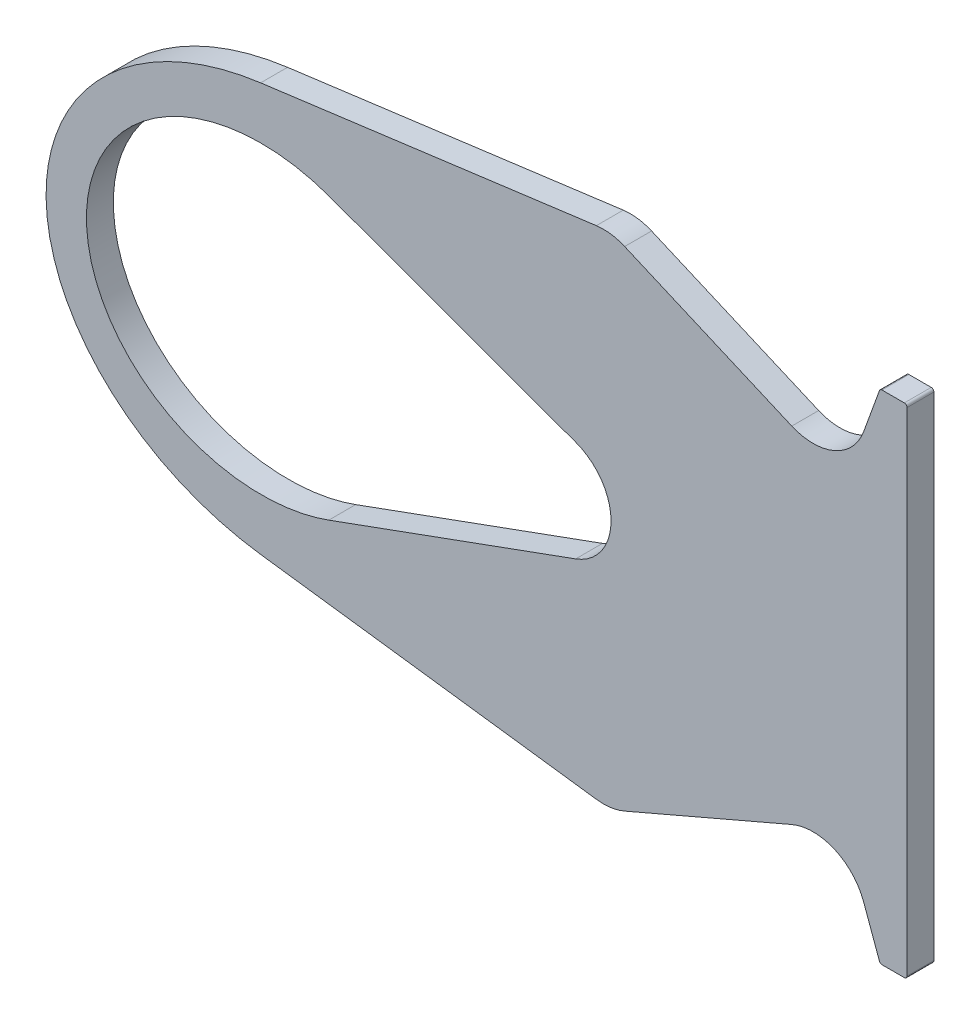
ISO-10303-21;
HEADER;
FILE_DESCRIPTION(('STEP AP214'),'2;1');
FILE_NAME('part.step','',(''),(''),'','','');
FILE_SCHEMA(('AUTOMOTIVE_DESIGN { 1 0 10303 214 1 1 1 1 }'));
ENDSEC;
DATA;
#1=APPLICATION_CONTEXT('core data for automotive mechanical design processes');
#2=APPLICATION_PROTOCOL_DEFINITION('international standard','automotive_design',2000,#1);
#3=PRODUCT_CONTEXT('',#1,'mechanical');
#4=PRODUCT('Part','Part','',(#3));
#5=PRODUCT_RELATED_PRODUCT_CATEGORY('part','',(#4));
#6=PRODUCT_DEFINITION_FORMATION('','',#4);
#7=PRODUCT_DEFINITION_CONTEXT('part definition',#1,'design');
#8=PRODUCT_DEFINITION('design','',#6,#7);
#9=PRODUCT_DEFINITION_SHAPE('','',#8);
#10=(LENGTH_UNIT() NAMED_UNIT(*) SI_UNIT(.MILLI.,.METRE.));
#11=(NAMED_UNIT(*) PLANE_ANGLE_UNIT() SI_UNIT($,.RADIAN.));
#12=(NAMED_UNIT(*) SI_UNIT($,.STERADIAN.) SOLID_ANGLE_UNIT());
#13=UNCERTAINTY_MEASURE_WITH_UNIT(LENGTH_MEASURE(1.E-05),#10,'distance_accuracy_value','');
#14=(GEOMETRIC_REPRESENTATION_CONTEXT(3) GLOBAL_UNCERTAINTY_ASSIGNED_CONTEXT((#13)) GLOBAL_UNIT_ASSIGNED_CONTEXT((#10,
#11,#12)) REPRESENTATION_CONTEXT('',''));
#15=CARTESIAN_POINT('',(0.,0.,0.));
#16=DIRECTION('',(0.,0.,1.));
#17=DIRECTION('',(1.,0.,0.));
#18=AXIS2_PLACEMENT_3D('',#15,#16,#17);
#19=CARTESIAN_POINT('',(-225.,0.,10.));
#20=DIRECTION('',(0.,0.,1.));
#21=DIRECTION('',(1.,0.,0.));
#22=AXIS2_PLACEMENT_3D('',#19,#20,#21);
#23=PLANE('',#22);
#24=CARTESIAN_POINT('',(-112.849996932684,72.5,10.));
#25=DIRECTION('',(0.,0.,1.));
#26=DIRECTION('',(-1.,0.,0.));
#27=AXIS2_PLACEMENT_3D('',#24,#25,#26);
#28=CIRCLE('',#27,19.9999999999999);
#29=CARTESIAN_POINT('',(-104.941269692229,90.8698675399713,10.));
#30=VERTEX_POINT('',#29);
#31=CARTESIAN_POINT('',(-115.460520777085,92.3288972274762,10.));
#32=VERTEX_POINT('',#31);
#33=EDGE_CURVE('E432',#30,#32,#28,.T.);
#34=ORIENTED_EDGE('',*,*,#33,.T.);
#35=DIRECTION('',(-0.99144486137381,-0.130526192220055,0.));
#36=VECTOR('',#35,1.);
#37=CARTESIAN_POINT('',(-115.460520777085,92.3288972274762,10.));
#38=LINE('',#37,#36);
#39=CARTESIAN_POINT('',(-240.250906005808,75.8999313372211,10.));
#40=VERTEX_POINT('',#39);
#41=EDGE_CURVE('E310',#32,#40,#38,.T.);
#42=ORIENTED_EDGE('',*,*,#41,.T.);
#43=CARTESIAN_POINT('',(-225.,0.,10.));
#44=DIRECTION('',(0.,0.,1.));
#45=DIRECTION('',(1.,0.,0.));
#46=AXIS2_PLACEMENT_3D('',#43,#44,#45);
#47=ELLIPSE('',#46,95.,76.8972884240534);
#48=CARTESIAN_POINT('',(-240.250906005808,-75.8999313372211,10.));
#49=VERTEX_POINT('',#48);
#50=EDGE_CURVE('E305',#40,#49,#47,.T.);
#51=ORIENTED_EDGE('',*,*,#50,.T.);
#52=DIRECTION('',(0.99144486137381,-0.130526192220055,0.));
#53=VECTOR('',#52,1.);
#54=CARTESIAN_POINT('',(-115.460520777085,-92.3288972274762,10.));
#55=LINE('',#54,#53);
#56=CARTESIAN_POINT('',(-115.460520777085,-92.3288972274762,10.));
#57=VERTEX_POINT('',#56);
#58=EDGE_CURVE('E309',#49,#57,#55,.T.);
#59=ORIENTED_EDGE('',*,*,#58,.T.);
#60=CARTESIAN_POINT('',(-112.849996932684,-72.5,10.));
#61=DIRECTION('',(0.,0.,1.));
#62=DIRECTION('',(1.,0.,0.));
#63=AXIS2_PLACEMENT_3D('',#60,#61,#62);
#64=CIRCLE('',#63,20.);
#65=CARTESIAN_POINT('',(-104.941269692229,-90.8698675399714,10.));
#66=VERTEX_POINT('',#65);
#67=EDGE_CURVE('E313',#57,#66,#64,.T.);
#68=ORIENTED_EDGE('',*,*,#67,.T.);
#69=DIRECTION('',(0.918493376998569,0.395436362022721,0.));
#70=VECTOR('',#69,1.);
#71=CARTESIAN_POINT('',(-42.8319850326347,-64.1301324600287,10.));
#72=LINE('',#71,#70);
#73=CARTESIAN_POINT('',(-42.8319850326347,-64.1301324600287,10.));
#74=VERTEX_POINT('',#73);
#75=EDGE_CURVE('E315',#66,#74,#72,.T.);
#76=ORIENTED_EDGE('',*,*,#75,.T.);
#77=CARTESIAN_POINT('',(-34.9232577921802,-82.5,10.));
#78=DIRECTION('',(0.,0.,-1.));
#79=DIRECTION('',(1.,0.,0.));
#80=AXIS2_PLACEMENT_3D('',#77,#78,#79);
#81=CIRCLE('',#80,20.);
#82=CARTESIAN_POINT('',(-16.1294053764621,-75.6595971334867,10.));
#83=VERTEX_POINT('',#82);
#84=EDGE_CURVE('E317',#74,#83,#81,.T.);
#85=ORIENTED_EDGE('',*,*,#84,.T.);
#86=DIRECTION('',(0.342020143325667,-0.939692620785909,0.));
#87=VECTOR('',#86,1.);
#88=CARTESIAN_POINT('',(-10.2394850825762,-91.8420201433257,10.));
#89=LINE('',#88,#87);
#90=CARTESIAN_POINT('',(-10.2394850825762,-91.8420201433257,10.));
#91=VERTEX_POINT('',#90);
#92=EDGE_CURVE('E319',#83,#91,#89,.T.);
#93=ORIENTED_EDGE('',*,*,#92,.T.);
#94=CARTESIAN_POINT('',(-9.29979246179027,-91.5,10.));
#95=DIRECTION('',(0.,0.,1.));
#96=DIRECTION('',(-1.,0.,0.));
#97=AXIS2_PLACEMENT_3D('',#94,#95,#96);
#98=CIRCLE('',#97,1.);
#99=CARTESIAN_POINT('',(-9.29979246179027,-92.5,10.));
#100=VERTEX_POINT('',#99);
#101=EDGE_CURVE('E321',#91,#100,#98,.T.);
#102=ORIENTED_EDGE('',*,*,#101,.T.);
#103=DIRECTION('',(1.,0.,0.));
#104=VECTOR('',#103,1.);
#105=CARTESIAN_POINT('',(-1.,-92.5,10.));
#106=LINE('',#105,#104);
#107=CARTESIAN_POINT('',(-1.,-92.5,10.));
#108=VERTEX_POINT('',#107);
#109=EDGE_CURVE('E323',#100,#108,#106,.T.);
#110=ORIENTED_EDGE('',*,*,#109,.T.);
#111=CARTESIAN_POINT('',(-1.,-91.5,10.));
#112=DIRECTION('',(0.,0.,1.));
#113=DIRECTION('',(1.,0.,0.));
#114=AXIS2_PLACEMENT_3D('',#111,#112,#113);
#115=CIRCLE('',#114,1.);
#116=CARTESIAN_POINT('',(0.,-91.5,10.));
#117=VERTEX_POINT('',#116);
#118=EDGE_CURVE('E325',#108,#117,#115,.T.);
#119=ORIENTED_EDGE('',*,*,#118,.T.);
#120=DIRECTION('',(0.,1.,0.));
#121=VECTOR('',#120,1.);
#122=CARTESIAN_POINT('',(0.,-91.5,10.));
#123=LINE('',#122,#121);
#124=CARTESIAN_POINT('',(0.,91.5,10.));
#125=VERTEX_POINT('',#124);
#126=EDGE_CURVE('E327',#117,#125,#123,.T.);
#127=ORIENTED_EDGE('',*,*,#126,.T.);
#128=CARTESIAN_POINT('',(-1.00000000000002,91.5,10.));
#129=DIRECTION('',(0.,0.,1.));
#130=DIRECTION('',(-1.,0.,0.));
#131=AXIS2_PLACEMENT_3D('',#128,#129,#130);
#132=CIRCLE('',#131,1.);
#133=CARTESIAN_POINT('',(-1.00000000000002,92.5,10.));
#134=VERTEX_POINT('',#133);
#135=EDGE_CURVE('E329',#125,#134,#132,.T.);
#136=ORIENTED_EDGE('',*,*,#135,.T.);
#137=DIRECTION('',(-1.,0.,0.));
#138=VECTOR('',#137,1.);
#139=CARTESIAN_POINT('',(-1.00000000000002,92.5,10.));
#140=LINE('',#139,#138);
#141=CARTESIAN_POINT('',(-9.29979246179029,92.5,10.));
#142=VERTEX_POINT('',#141);
#143=EDGE_CURVE('E331',#134,#142,#140,.T.);
#144=ORIENTED_EDGE('',*,*,#143,.T.);
#145=CARTESIAN_POINT('',(-9.29979246179029,91.5,10.));
#146=DIRECTION('',(0.,0.,1.));
#147=DIRECTION('',(-1.,0.,0.));
#148=AXIS2_PLACEMENT_3D('',#145,#146,#147);
#149=CIRCLE('',#148,1.);
#150=CARTESIAN_POINT('',(-10.2394850825762,91.8420201433257,10.));
#151=VERTEX_POINT('',#150);
#152=EDGE_CURVE('E333',#142,#151,#149,.T.);
#153=ORIENTED_EDGE('',*,*,#152,.T.);
#154=DIRECTION('',(-0.342020143325668,-0.939692620785909,0.));
#155=VECTOR('',#154,1.);
#156=CARTESIAN_POINT('',(-10.2394850825762,91.8420201433257,10.));
#157=LINE('',#156,#155);
#158=CARTESIAN_POINT('',(-16.1294053764621,75.6595971334866,10.));
#159=VERTEX_POINT('',#158);
#160=EDGE_CURVE('E335',#151,#159,#157,.T.);
#161=ORIENTED_EDGE('',*,*,#160,.T.);
#162=CARTESIAN_POINT('',(-34.9232577921802,82.5,10.));
#163=DIRECTION('',(0.,0.,-1.));
#164=DIRECTION('',(-1.,0.,0.));
#165=AXIS2_PLACEMENT_3D('',#162,#163,#164);
#166=CIRCLE('',#165,20.);
#167=CARTESIAN_POINT('',(-42.8319850326347,64.1301324600286,10.));
#168=VERTEX_POINT('',#167);
#169=EDGE_CURVE('E337',#159,#168,#166,.T.);
#170=ORIENTED_EDGE('',*,*,#169,.T.);
#171=DIRECTION('',(-0.918493376998569,0.395436362022721,0.));
#172=VECTOR('',#171,1.);
#173=CARTESIAN_POINT('',(-42.8319850326347,64.1301324600287,10.));
#174=LINE('',#173,#172);
#175=EDGE_CURVE('E339',#168,#30,#174,.T.);
#176=ORIENTED_EDGE('',*,*,#175,.T.);
#177=EDGE_LOOP('',(#34,#42,#51,#59,#68,#76,#85,#93,#102,#110,#119,#127,#136,#144,#153,#161,#170,#176));
#178=FACE_BOUND('',#177,.T.);
#179=DIRECTION('',(-0.939692620785908,0.34202014332567,0.));
#180=VECTOR('',#179,1.);
#181=CARTESIAN_POINT('',(-214.922257217189,52.1927293032733,10.));
#182=LINE('',#181,#180);
#183=CARTESIAN_POINT('',(-123.159597133487,18.7938524157181,10.));
#184=VERTEX_POINT('',#183);
#185=CARTESIAN_POINT('',(-214.922257217189,52.1927293032733,10.));
#186=VERTEX_POINT('',#185);
#187=EDGE_CURVE('E216',#184,#186,#182,.T.);
#188=ORIENTED_EDGE('',*,*,#187,.F.);
#189=CARTESIAN_POINT('',(-130.,0.,10.));
#190=DIRECTION('',(0.,0.,1.));
#191=DIRECTION('',(1.,0.,0.));
#192=AXIS2_PLACEMENT_3D('',#189,#190,#191);
#193=CIRCLE('',#192,20.);
#194=CARTESIAN_POINT('',(-123.159597133487,-18.7938524157182,10.));
#195=VERTEX_POINT('',#194);
#196=EDGE_CURVE('E205',#195,#184,#193,.T.);
#197=ORIENTED_EDGE('',*,*,#196,.F.);
#198=DIRECTION('',(0.939692620785908,0.34202014332567,0.));
#199=VECTOR('',#198,1.);
#200=CARTESIAN_POINT('',(-214.922257217189,-52.1927293032734,10.));
#201=LINE('',#200,#199);
#202=CARTESIAN_POINT('',(-214.922257217189,-52.1927293032734,10.));
#203=VERTEX_POINT('',#202);
#204=EDGE_CURVE('E221',#203,#195,#201,.T.);
#205=ORIENTED_EDGE('',*,*,#204,.F.);
#206=CARTESIAN_POINT('',(-240.,0.,10.));
#207=DIRECTION('',(0.,0.,1.));
#208=DIRECTION('',(1.,0.,0.));
#209=AXIS2_PLACEMENT_3D('',#206,#207,#208);
#210=ELLIPSE('',#209,65.,56.5727216815088);
#211=EDGE_CURVE('E218',#186,#203,#210,.T.);
#212=ORIENTED_EDGE('',*,*,#211,.F.);
#213=EDGE_LOOP('',(#188,#197,#205,#212));
#214=FACE_BOUND('',#213,.T.);
#215=ADVANCED_FACE('F41',(#178,#214),#23,.T.);
#216=CARTESIAN_POINT('',(-225.,0.,0.));
#217=DIRECTION('',(0.,0.,1.));
#218=DIRECTION('',(1.,0.,0.));
#219=AXIS2_PLACEMENT_3D('',#216,#217,#218);
#220=PLANE('',#219);
#221=CARTESIAN_POINT('',(-112.849996932684,72.5,0.));
#222=DIRECTION('',(0.,0.,1.));
#223=DIRECTION('',(-1.,0.,0.));
#224=AXIS2_PLACEMENT_3D('',#221,#222,#223);
#225=CIRCLE('',#224,19.9999999999999);
#226=CARTESIAN_POINT('',(-104.941269692229,90.8698675399713,0.));
#227=VERTEX_POINT('',#226);
#228=CARTESIAN_POINT('',(-115.460520777085,92.3288972274762,0.));
#229=VERTEX_POINT('',#228);
#230=EDGE_CURVE('E206',#227,#229,#225,.T.);
#231=ORIENTED_EDGE('',*,*,#230,.F.);
#232=DIRECTION('',(-0.918493376998569,0.395436362022721,0.));
#233=VECTOR('',#232,1.);
#234=CARTESIAN_POINT('',(-42.8319850326347,64.1301324600287,0.));
#235=LINE('',#234,#233);
#236=CARTESIAN_POINT('',(-42.8319850326347,64.1301324600286,0.));
#237=VERTEX_POINT('',#236);
#238=EDGE_CURVE('E431',#237,#227,#235,.T.);
#239=ORIENTED_EDGE('',*,*,#238,.F.);
#240=CARTESIAN_POINT('',(-34.9232577921802,82.5,0.));
#241=DIRECTION('',(0.,0.,-1.));
#242=DIRECTION('',(-1.,0.,0.));
#243=AXIS2_PLACEMENT_3D('',#240,#241,#242);
#244=CIRCLE('',#243,20.);
#245=CARTESIAN_POINT('',(-16.1294053764621,75.6595971334866,0.));
#246=VERTEX_POINT('',#245);
#247=EDGE_CURVE('E429',#246,#237,#244,.T.);
#248=ORIENTED_EDGE('',*,*,#247,.F.);
#249=DIRECTION('',(-0.342020143325668,-0.939692620785909,0.));
#250=VECTOR('',#249,1.);
#251=CARTESIAN_POINT('',(-10.2394850825762,91.8420201433257,0.));
#252=LINE('',#251,#250);
#253=CARTESIAN_POINT('',(-10.2394850825762,91.8420201433257,0.));
#254=VERTEX_POINT('',#253);
#255=EDGE_CURVE('E427',#254,#246,#252,.T.);
#256=ORIENTED_EDGE('',*,*,#255,.F.);
#257=CARTESIAN_POINT('',(-9.29979246179029,91.5,0.));
#258=DIRECTION('',(0.,0.,1.));
#259=DIRECTION('',(-1.,0.,0.));
#260=AXIS2_PLACEMENT_3D('',#257,#258,#259);
#261=CIRCLE('',#260,1.);
#262=CARTESIAN_POINT('',(-9.29979246179029,92.5,0.));
#263=VERTEX_POINT('',#262);
#264=EDGE_CURVE('E425',#263,#254,#261,.T.);
#265=ORIENTED_EDGE('',*,*,#264,.F.);
#266=DIRECTION('',(-1.,0.,0.));
#267=VECTOR('',#266,1.);
#268=CARTESIAN_POINT('',(-1.00000000000002,92.5,0.));
#269=LINE('',#268,#267);
#270=CARTESIAN_POINT('',(-1.00000000000002,92.5,0.));
#271=VERTEX_POINT('',#270);
#272=EDGE_CURVE('E423',#271,#263,#269,.T.);
#273=ORIENTED_EDGE('',*,*,#272,.F.);
#274=CARTESIAN_POINT('',(-1.00000000000002,91.5,0.));
#275=DIRECTION('',(0.,0.,1.));
#276=DIRECTION('',(-1.,0.,0.));
#277=AXIS2_PLACEMENT_3D('',#274,#275,#276);
#278=CIRCLE('',#277,1.);
#279=CARTESIAN_POINT('',(0.,91.5,0.));
#280=VERTEX_POINT('',#279);
#281=EDGE_CURVE('E421',#280,#271,#278,.T.);
#282=ORIENTED_EDGE('',*,*,#281,.F.);
#283=DIRECTION('',(0.,1.,0.));
#284=VECTOR('',#283,1.);
#285=CARTESIAN_POINT('',(0.,-91.5,0.));
#286=LINE('',#285,#284);
#287=CARTESIAN_POINT('',(0.,-91.5,0.));
#288=VERTEX_POINT('',#287);
#289=EDGE_CURVE('E419',#288,#280,#286,.T.);
#290=ORIENTED_EDGE('',*,*,#289,.F.);
#291=CARTESIAN_POINT('',(-1.,-91.5,0.));
#292=DIRECTION('',(0.,0.,1.));
#293=DIRECTION('',(1.,0.,0.));
#294=AXIS2_PLACEMENT_3D('',#291,#292,#293);
#295=CIRCLE('',#294,1.);
#296=CARTESIAN_POINT('',(-1.,-92.5,0.));
#297=VERTEX_POINT('',#296);
#298=EDGE_CURVE('E417',#297,#288,#295,.T.);
#299=ORIENTED_EDGE('',*,*,#298,.F.);
#300=DIRECTION('',(1.,0.,0.));
#301=VECTOR('',#300,1.);
#302=CARTESIAN_POINT('',(-1.,-92.5,0.));
#303=LINE('',#302,#301);
#304=CARTESIAN_POINT('',(-9.29979246179027,-92.5,0.));
#305=VERTEX_POINT('',#304);
#306=EDGE_CURVE('E415',#305,#297,#303,.T.);
#307=ORIENTED_EDGE('',*,*,#306,.F.);
#308=CARTESIAN_POINT('',(-9.29979246179027,-91.5,0.));
#309=DIRECTION('',(0.,0.,1.));
#310=DIRECTION('',(-1.,0.,0.));
#311=AXIS2_PLACEMENT_3D('',#308,#309,#310);
#312=CIRCLE('',#311,1.);
#313=CARTESIAN_POINT('',(-10.2394850825762,-91.8420201433257,0.));
#314=VERTEX_POINT('',#313);
#315=EDGE_CURVE('E413',#314,#305,#312,.T.);
#316=ORIENTED_EDGE('',*,*,#315,.F.);
#317=DIRECTION('',(0.342020143325667,-0.939692620785909,0.));
#318=VECTOR('',#317,1.);
#319=CARTESIAN_POINT('',(-10.2394850825762,-91.8420201433257,0.));
#320=LINE('',#319,#318);
#321=CARTESIAN_POINT('',(-16.1294053764621,-75.6595971334867,0.));
#322=VERTEX_POINT('',#321);
#323=EDGE_CURVE('E411',#322,#314,#320,.T.);
#324=ORIENTED_EDGE('',*,*,#323,.F.);
#325=CARTESIAN_POINT('',(-34.9232577921802,-82.5,0.));
#326=DIRECTION('',(0.,0.,-1.));
#327=DIRECTION('',(1.,0.,0.));
#328=AXIS2_PLACEMENT_3D('',#325,#326,#327);
#329=CIRCLE('',#328,20.);
#330=CARTESIAN_POINT('',(-42.8319850326347,-64.1301324600287,0.));
#331=VERTEX_POINT('',#330);
#332=EDGE_CURVE('E409',#331,#322,#329,.T.);
#333=ORIENTED_EDGE('',*,*,#332,.F.);
#334=DIRECTION('',(0.918493376998569,0.395436362022721,0.));
#335=VECTOR('',#334,1.);
#336=CARTESIAN_POINT('',(-42.8319850326347,-64.1301324600287,0.));
#337=LINE('',#336,#335);
#338=CARTESIAN_POINT('',(-104.941269692229,-90.8698675399714,0.));
#339=VERTEX_POINT('',#338);
#340=EDGE_CURVE('E407',#339,#331,#337,.T.);
#341=ORIENTED_EDGE('',*,*,#340,.F.);
#342=CARTESIAN_POINT('',(-112.849996932684,-72.5,0.));
#343=DIRECTION('',(0.,0.,1.));
#344=DIRECTION('',(1.,0.,0.));
#345=AXIS2_PLACEMENT_3D('',#342,#343,#344);
#346=CIRCLE('',#345,20.);
#347=CARTESIAN_POINT('',(-115.460520777085,-92.3288972274762,0.));
#348=VERTEX_POINT('',#347);
#349=EDGE_CURVE('E401',#348,#339,#346,.T.);
#350=ORIENTED_EDGE('',*,*,#349,.F.);
#351=DIRECTION('',(0.99144486137381,-0.130526192220055,0.));
#352=VECTOR('',#351,1.);
#353=CARTESIAN_POINT('',(-115.460520777085,-92.3288972274762,0.));
#354=LINE('',#353,#352);
#355=CARTESIAN_POINT('',(-240.250906005808,-75.8999313372211,0.));
#356=VERTEX_POINT('',#355);
#357=EDGE_CURVE('E399',#356,#348,#354,.T.);
#358=ORIENTED_EDGE('',*,*,#357,.F.);
#359=CARTESIAN_POINT('',(-225.,0.,0.));
#360=DIRECTION('',(0.,0.,1.));
#361=DIRECTION('',(1.,0.,0.));
#362=AXIS2_PLACEMENT_3D('',#359,#360,#361);
#363=ELLIPSE('',#362,95.,76.8972884240534);
#364=CARTESIAN_POINT('',(-240.250906005808,75.8999313372211,0.));
#365=VERTEX_POINT('',#364);
#366=EDGE_CURVE('E393',#365,#356,#363,.T.);
#367=ORIENTED_EDGE('',*,*,#366,.F.);
#368=DIRECTION('',(-0.99144486137381,-0.130526192220055,0.));
#369=VECTOR('',#368,1.);
#370=CARTESIAN_POINT('',(-115.460520777085,92.3288972274762,0.));
#371=LINE('',#370,#369);
#372=EDGE_CURVE('E397',#229,#365,#371,.T.);
#373=ORIENTED_EDGE('',*,*,#372,.F.);
#374=EDGE_LOOP('',(#231,#239,#248,#256,#265,#273,#282,#290,#299,#307,#316,#324,#333,#341,#350,
#358,#367,#373));
#375=FACE_BOUND('',#374,.T.);
#376=CARTESIAN_POINT('',(-130.,0.,0.));
#377=DIRECTION('',(0.,0.,1.));
#378=DIRECTION('',(1.,0.,0.));
#379=AXIS2_PLACEMENT_3D('',#376,#377,#378);
#380=CIRCLE('',#379,20.);
#381=CARTESIAN_POINT('',(-123.159597133487,-18.7938524157182,0.));
#382=VERTEX_POINT('',#381);
#383=CARTESIAN_POINT('',(-123.159597133487,18.7938524157181,0.));
#384=VERTEX_POINT('',#383);
#385=EDGE_CURVE('E64',#382,#384,#380,.T.);
#386=ORIENTED_EDGE('',*,*,#385,.T.);
#387=DIRECTION('',(-0.939692620785908,0.34202014332567,0.));
#388=VECTOR('',#387,1.);
#389=CARTESIAN_POINT('',(-214.922257217189,52.1927293032733,0.));
#390=LINE('',#389,#388);
#391=CARTESIAN_POINT('',(-214.922257217189,52.1927293032733,0.));
#392=VERTEX_POINT('',#391);
#393=EDGE_CURVE('E192',#384,#392,#390,.T.);
#394=ORIENTED_EDGE('',*,*,#393,.T.);
#395=CARTESIAN_POINT('',(-240.,0.,0.));
#396=DIRECTION('',(0.,0.,1.));
#397=DIRECTION('',(1.,0.,0.));
#398=AXIS2_PLACEMENT_3D('',#395,#396,#397);
#399=ELLIPSE('',#398,65.,56.5727216815088);
#400=CARTESIAN_POINT('',(-214.922257217189,-52.1927293032734,0.));
#401=VERTEX_POINT('',#400);
#402=EDGE_CURVE('E201',#392,#401,#399,.T.);
#403=ORIENTED_EDGE('',*,*,#402,.T.);
#404=DIRECTION('',(0.939692620785908,0.34202014332567,0.));
#405=VECTOR('',#404,1.);
#406=CARTESIAN_POINT('',(-214.922257217189,-52.1927293032734,0.));
#407=LINE('',#406,#405);
#408=EDGE_CURVE('E210',#401,#382,#407,.T.);
#409=ORIENTED_EDGE('',*,*,#408,.T.);
#410=EDGE_LOOP('',(#386,#394,#403,#409));
#411=FACE_BOUND('',#410,.T.);
#412=ADVANCED_FACE('F209',(#375,#411),#220,.F.);
#413=CARTESIAN_POINT('',(-112.849996932684,72.5,10.));
#414=DIRECTION('',(0.,0.,-1.));
#415=DIRECTION('',(-1.,0.,0.));
#416=AXIS2_PLACEMENT_3D('',#413,#414,#415);
#417=CYLINDRICAL_SURFACE('',#416,19.9999999999999);
#418=ORIENTED_EDGE('',*,*,#230,.T.);
#419=DIRECTION('',(0.,0.,-1.));
#420=VECTOR('',#419,1.);
#421=CARTESIAN_POINT('',(-115.460520777085,92.3288972274762,10.));
#422=LINE('',#421,#420);
#423=EDGE_CURVE('E11',#32,#229,#422,.T.);
#424=ORIENTED_EDGE('',*,*,#423,.F.);
#425=ORIENTED_EDGE('',*,*,#33,.F.);
#426=DIRECTION('',(0.,0.,-1.));
#427=VECTOR('',#426,1.);
#428=CARTESIAN_POINT('',(-104.941269692229,90.8698675399713,10.));
#429=LINE('',#428,#427);
#430=EDGE_CURVE('E341',#30,#227,#429,.T.);
#431=ORIENTED_EDGE('',*,*,#430,.T.);
#432=EDGE_LOOP('',(#418,#424,#425,#431));
#433=FACE_BOUND('',#432,.T.);
#434=ADVANCED_FACE('F43',(#433),#417,.T.);
#435=CARTESIAN_POINT('',(-115.460520777085,92.3288972274762,10.));
#436=DIRECTION('',(0.130526192220055,-0.99144486137381,0.));
#437=DIRECTION('',(0.99144486137381,0.130526192220055,0.));
#438=AXIS2_PLACEMENT_3D('',#435,#436,#437);
#439=PLANE('',#438);
#440=ORIENTED_EDGE('',*,*,#372,.T.);
#441=DIRECTION('',(0.,0.,-1.));
#442=VECTOR('',#441,1.);
#443=CARTESIAN_POINT('',(-240.250906005808,75.8999313372211,10.));
#444=LINE('',#443,#442);
#445=EDGE_CURVE('E49',#40,#365,#444,.T.);
#446=ORIENTED_EDGE('',*,*,#445,.F.);
#447=ORIENTED_EDGE('',*,*,#41,.F.);
#448=ORIENTED_EDGE('',*,*,#423,.T.);
#449=EDGE_LOOP('',(#440,#446,#447,#448));
#450=FACE_BOUND('',#449,.T.);
#451=ADVANCED_FACE('F303',(#450),#439,.F.);
#452=DIRECTION('',(0.,0.,-1.));
#453=VECTOR('',#452,1.);
#454=SURFACE_OF_LINEAR_EXTRUSION('',#47,#453);
#455=ORIENTED_EDGE('',*,*,#366,.T.);
#456=DIRECTION('',(0.,0.,-1.));
#457=VECTOR('',#456,1.);
#458=CARTESIAN_POINT('',(-240.250906005808,-75.8999313372211,10.));
#459=LINE('',#458,#457);
#460=EDGE_CURVE('E386',#49,#356,#459,.T.);
#461=ORIENTED_EDGE('',*,*,#460,.F.);
#462=ORIENTED_EDGE('',*,*,#50,.F.);
#463=ORIENTED_EDGE('',*,*,#445,.T.);
#464=EDGE_LOOP('',(#455,#461,#462,#463));
#465=FACE_BOUND('',#464,.T.);
#466=ADVANCED_FACE('F299',(#465),#454,.F.);
#467=CARTESIAN_POINT('',(-115.460520777085,-92.3288972274762,10.));
#468=DIRECTION('',(0.130526192220055,0.99144486137381,0.));
#469=DIRECTION('',(-0.99144486137381,0.130526192220055,0.));
#470=AXIS2_PLACEMENT_3D('',#467,#468,#469);
#471=PLANE('',#470);
#472=ORIENTED_EDGE('',*,*,#357,.T.);
#473=DIRECTION('',(0.,0.,-1.));
#474=VECTOR('',#473,1.);
#475=CARTESIAN_POINT('',(-115.460520777085,-92.3288972274762,10.));
#476=LINE('',#475,#474);
#477=EDGE_CURVE('E383',#57,#348,#476,.T.);
#478=ORIENTED_EDGE('',*,*,#477,.F.);
#479=ORIENTED_EDGE('',*,*,#58,.F.);
#480=ORIENTED_EDGE('',*,*,#460,.T.);
#481=EDGE_LOOP('',(#472,#478,#479,#480));
#482=FACE_BOUND('',#481,.T.);
#483=ADVANCED_FACE('F295',(#482),#471,.F.);
#484=CARTESIAN_POINT('',(-112.849996932684,-72.5,10.));
#485=DIRECTION('',(0.,0.,-1.));
#486=DIRECTION('',(-1.,0.,0.));
#487=AXIS2_PLACEMENT_3D('',#484,#485,#486);
#488=CYLINDRICAL_SURFACE('',#487,20.);
#489=ORIENTED_EDGE('',*,*,#349,.T.);
#490=DIRECTION('',(0.,0.,-1.));
#491=VECTOR('',#490,1.);
#492=CARTESIAN_POINT('',(-104.941269692229,-90.8698675399714,10.));
#493=LINE('',#492,#491);
#494=EDGE_CURVE('E380',#66,#339,#493,.T.);
#495=ORIENTED_EDGE('',*,*,#494,.F.);
#496=ORIENTED_EDGE('',*,*,#67,.F.);
#497=ORIENTED_EDGE('',*,*,#477,.T.);
#498=EDGE_LOOP('',(#489,#495,#496,#497));
#499=FACE_BOUND('',#498,.T.);
#500=ADVANCED_FACE('F291',(#499),#488,.T.);
#501=CARTESIAN_POINT('',(-42.8319850326347,-64.1301324600287,10.));
#502=DIRECTION('',(-0.395436362022721,0.918493376998569,0.));
#503=DIRECTION('',(-0.918493376998569,-0.395436362022721,0.));
#504=AXIS2_PLACEMENT_3D('',#501,#502,#503);
#505=PLANE('',#504);
#506=ORIENTED_EDGE('',*,*,#340,.T.);
#507=DIRECTION('',(0.,0.,-1.));
#508=VECTOR('',#507,1.);
#509=CARTESIAN_POINT('',(-42.8319850326347,-64.1301324600287,10.));
#510=LINE('',#509,#508);
#511=EDGE_CURVE('E377',#74,#331,#510,.T.);
#512=ORIENTED_EDGE('',*,*,#511,.F.);
#513=ORIENTED_EDGE('',*,*,#75,.F.);
#514=ORIENTED_EDGE('',*,*,#494,.T.);
#515=EDGE_LOOP('',(#506,#512,#513,#514));
#516=FACE_BOUND('',#515,.T.);
#517=ADVANCED_FACE('F287',(#516),#505,.F.);
#518=CARTESIAN_POINT('',(-34.9232577921802,-82.5,10.));
#519=DIRECTION('',(0.,0.,-1.));
#520=DIRECTION('',(-1.,0.,0.));
#521=AXIS2_PLACEMENT_3D('',#518,#519,#520);
#522=CYLINDRICAL_SURFACE('',#521,20.);
#523=ORIENTED_EDGE('',*,*,#332,.T.);
#524=DIRECTION('',(0.,0.,-1.));
#525=VECTOR('',#524,1.);
#526=CARTESIAN_POINT('',(-16.1294053764621,-75.6595971334867,10.));
#527=LINE('',#526,#525);
#528=EDGE_CURVE('E374',#83,#322,#527,.T.);
#529=ORIENTED_EDGE('',*,*,#528,.F.);
#530=ORIENTED_EDGE('',*,*,#84,.F.);
#531=ORIENTED_EDGE('',*,*,#511,.T.);
#532=EDGE_LOOP('',(#523,#529,#530,#531));
#533=FACE_BOUND('',#532,.T.);
#534=ADVANCED_FACE('F283',(#533),#522,.F.);
#535=CARTESIAN_POINT('',(-10.2394850825762,-91.8420201433257,10.));
#536=DIRECTION('',(0.939692620785909,0.342020143325667,0.));
#537=DIRECTION('',(-0.342020143325667,0.939692620785909,0.));
#538=AXIS2_PLACEMENT_3D('',#535,#536,#537);
#539=PLANE('',#538);
#540=ORIENTED_EDGE('',*,*,#323,.T.);
#541=DIRECTION('',(0.,0.,-1.));
#542=VECTOR('',#541,1.);
#543=CARTESIAN_POINT('',(-10.2394850825762,-91.8420201433257,10.));
#544=LINE('',#543,#542);
#545=EDGE_CURVE('E371',#91,#314,#544,.T.);
#546=ORIENTED_EDGE('',*,*,#545,.F.);
#547=ORIENTED_EDGE('',*,*,#92,.F.);
#548=ORIENTED_EDGE('',*,*,#528,.T.);
#549=EDGE_LOOP('',(#540,#546,#547,#548));
#550=FACE_BOUND('',#549,.T.);
#551=ADVANCED_FACE('F279',(#550),#539,.F.);
#552=CARTESIAN_POINT('',(-9.29979246179027,-91.5,10.));
#553=DIRECTION('',(0.,0.,-1.));
#554=DIRECTION('',(-1.,0.,0.));
#555=AXIS2_PLACEMENT_3D('',#552,#553,#554);
#556=CYLINDRICAL_SURFACE('',#555,1.);
#557=ORIENTED_EDGE('',*,*,#315,.T.);
#558=DIRECTION('',(0.,0.,-1.));
#559=VECTOR('',#558,1.);
#560=CARTESIAN_POINT('',(-9.29979246179027,-92.5,10.));
#561=LINE('',#560,#559);
#562=EDGE_CURVE('E368',#100,#305,#561,.T.);
#563=ORIENTED_EDGE('',*,*,#562,.F.);
#564=ORIENTED_EDGE('',*,*,#101,.F.);
#565=ORIENTED_EDGE('',*,*,#545,.T.);
#566=EDGE_LOOP('',(#557,#563,#564,#565));
#567=FACE_BOUND('',#566,.T.);
#568=ADVANCED_FACE('F275',(#567),#556,.T.);
#569=CARTESIAN_POINT('',(-1.,-92.5,10.));
#570=DIRECTION('',(0.,1.,0.));
#571=DIRECTION('',(0.,0.,1.));
#572=AXIS2_PLACEMENT_3D('',#569,#570,#571);
#573=PLANE('',#572);
#574=ORIENTED_EDGE('',*,*,#306,.T.);
#575=DIRECTION('',(0.,0.,-1.));
#576=VECTOR('',#575,1.);
#577=CARTESIAN_POINT('',(-1.,-92.5,10.));
#578=LINE('',#577,#576);
#579=EDGE_CURVE('E365',#108,#297,#578,.T.);
#580=ORIENTED_EDGE('',*,*,#579,.F.);
#581=ORIENTED_EDGE('',*,*,#109,.F.);
#582=ORIENTED_EDGE('',*,*,#562,.T.);
#583=EDGE_LOOP('',(#574,#580,#581,#582));
#584=FACE_BOUND('',#583,.T.);
#585=ADVANCED_FACE('F271',(#584),#573,.F.);
#586=CARTESIAN_POINT('',(-1.,-91.5,10.));
#587=DIRECTION('',(0.,0.,-1.));
#588=DIRECTION('',(-1.,0.,0.));
#589=AXIS2_PLACEMENT_3D('',#586,#587,#588);
#590=CYLINDRICAL_SURFACE('',#589,1.);
#591=ORIENTED_EDGE('',*,*,#298,.T.);
#592=DIRECTION('',(0.,0.,-1.));
#593=VECTOR('',#592,1.);
#594=CARTESIAN_POINT('',(0.,-91.5,10.));
#595=LINE('',#594,#593);
#596=EDGE_CURVE('E362',#117,#288,#595,.T.);
#597=ORIENTED_EDGE('',*,*,#596,.F.);
#598=ORIENTED_EDGE('',*,*,#118,.F.);
#599=ORIENTED_EDGE('',*,*,#579,.T.);
#600=EDGE_LOOP('',(#591,#597,#598,#599));
#601=FACE_BOUND('',#600,.T.);
#602=ADVANCED_FACE('F267',(#601),#590,.T.);
#603=CARTESIAN_POINT('',(0.,-91.5,10.));
#604=DIRECTION('',(-1.,0.,0.));
#605=DIRECTION('',(0.,-1.,0.));
#606=AXIS2_PLACEMENT_3D('',#603,#604,#605);
#607=PLANE('',#606);
#608=ORIENTED_EDGE('',*,*,#289,.T.);
#609=DIRECTION('',(0.,0.,-1.));
#610=VECTOR('',#609,1.);
#611=CARTESIAN_POINT('',(0.,91.5,10.));
#612=LINE('',#611,#610);
#613=EDGE_CURVE('E359',#125,#280,#612,.T.);
#614=ORIENTED_EDGE('',*,*,#613,.F.);
#615=ORIENTED_EDGE('',*,*,#126,.F.);
#616=ORIENTED_EDGE('',*,*,#596,.T.);
#617=EDGE_LOOP('',(#608,#614,#615,#616));
#618=FACE_BOUND('',#617,.T.);
#619=ADVANCED_FACE('F263',(#618),#607,.F.);
#620=CARTESIAN_POINT('',(-1.00000000000002,91.5,10.));
#621=DIRECTION('',(0.,0.,-1.));
#622=DIRECTION('',(-1.,0.,0.));
#623=AXIS2_PLACEMENT_3D('',#620,#621,#622);
#624=CYLINDRICAL_SURFACE('',#623,1.);
#625=ORIENTED_EDGE('',*,*,#281,.T.);
#626=DIRECTION('',(0.,0.,-1.));
#627=VECTOR('',#626,1.);
#628=CARTESIAN_POINT('',(-1.00000000000002,92.5,10.));
#629=LINE('',#628,#627);
#630=EDGE_CURVE('E356',#134,#271,#629,.T.);
#631=ORIENTED_EDGE('',*,*,#630,.F.);
#632=ORIENTED_EDGE('',*,*,#135,.F.);
#633=ORIENTED_EDGE('',*,*,#613,.T.);
#634=EDGE_LOOP('',(#625,#631,#632,#633));
#635=FACE_BOUND('',#634,.T.);
#636=ADVANCED_FACE('F259',(#635),#624,.T.);
#637=CARTESIAN_POINT('',(-1.00000000000002,92.5,10.));
#638=DIRECTION('',(0.,-1.,0.));
#639=DIRECTION('',(0.,0.,-1.));
#640=AXIS2_PLACEMENT_3D('',#637,#638,#639);
#641=PLANE('',#640);
#642=ORIENTED_EDGE('',*,*,#272,.T.);
#643=DIRECTION('',(0.,0.,-1.));
#644=VECTOR('',#643,1.);
#645=CARTESIAN_POINT('',(-9.29979246179029,92.5,10.));
#646=LINE('',#645,#644);
#647=EDGE_CURVE('E353',#142,#263,#646,.T.);
#648=ORIENTED_EDGE('',*,*,#647,.F.);
#649=ORIENTED_EDGE('',*,*,#143,.F.);
#650=ORIENTED_EDGE('',*,*,#630,.T.);
#651=EDGE_LOOP('',(#642,#648,#649,#650));
#652=FACE_BOUND('',#651,.T.);
#653=ADVANCED_FACE('F255',(#652),#641,.F.);
#654=CARTESIAN_POINT('',(-9.29979246179029,91.5,10.));
#655=DIRECTION('',(0.,0.,-1.));
#656=DIRECTION('',(-1.,0.,0.));
#657=AXIS2_PLACEMENT_3D('',#654,#655,#656);
#658=CYLINDRICAL_SURFACE('',#657,1.);
#659=ORIENTED_EDGE('',*,*,#264,.T.);
#660=DIRECTION('',(0.,0.,-1.));
#661=VECTOR('',#660,1.);
#662=CARTESIAN_POINT('',(-10.2394850825762,91.8420201433257,10.));
#663=LINE('',#662,#661);
#664=EDGE_CURVE('E350',#151,#254,#663,.T.);
#665=ORIENTED_EDGE('',*,*,#664,.F.);
#666=ORIENTED_EDGE('',*,*,#152,.F.);
#667=ORIENTED_EDGE('',*,*,#647,.T.);
#668=EDGE_LOOP('',(#659,#665,#666,#667));
#669=FACE_BOUND('',#668,.T.);
#670=ADVANCED_FACE('F251',(#669),#658,.T.);
#671=CARTESIAN_POINT('',(-10.2394850825762,91.8420201433257,10.));
#672=DIRECTION('',(0.939692620785909,-0.342020143325668,0.));
#673=DIRECTION('',(0.342020143325668,0.939692620785909,0.));
#674=AXIS2_PLACEMENT_3D('',#671,#672,#673);
#675=PLANE('',#674);
#676=ORIENTED_EDGE('',*,*,#255,.T.);
#677=DIRECTION('',(0.,0.,-1.));
#678=VECTOR('',#677,1.);
#679=CARTESIAN_POINT('',(-16.1294053764621,75.6595971334866,10.));
#680=LINE('',#679,#678);
#681=EDGE_CURVE('E347',#159,#246,#680,.T.);
#682=ORIENTED_EDGE('',*,*,#681,.F.);
#683=ORIENTED_EDGE('',*,*,#160,.F.);
#684=ORIENTED_EDGE('',*,*,#664,.T.);
#685=EDGE_LOOP('',(#676,#682,#683,#684));
#686=FACE_BOUND('',#685,.T.);
#687=ADVANCED_FACE('F247',(#686),#675,.F.);
#688=CARTESIAN_POINT('',(-34.9232577921802,82.5,10.));
#689=DIRECTION('',(0.,0.,-1.));
#690=DIRECTION('',(-1.,0.,0.));
#691=AXIS2_PLACEMENT_3D('',#688,#689,#690);
#692=CYLINDRICAL_SURFACE('',#691,20.);
#693=ORIENTED_EDGE('',*,*,#247,.T.);
#694=DIRECTION('',(0.,0.,-1.));
#695=VECTOR('',#694,1.);
#696=CARTESIAN_POINT('',(-42.8319850326347,64.1301324600286,10.));
#697=LINE('',#696,#695);
#698=EDGE_CURVE('E344',#168,#237,#697,.T.);
#699=ORIENTED_EDGE('',*,*,#698,.F.);
#700=ORIENTED_EDGE('',*,*,#169,.F.);
#701=ORIENTED_EDGE('',*,*,#681,.T.);
#702=EDGE_LOOP('',(#693,#699,#700,#701));
#703=FACE_BOUND('',#702,.T.);
#704=ADVANCED_FACE('F243',(#703),#692,.F.);
#705=CARTESIAN_POINT('',(-42.8319850326347,64.1301324600287,10.));
#706=DIRECTION('',(-0.395436362022721,-0.918493376998569,0.));
#707=DIRECTION('',(0.918493376998569,-0.395436362022721,0.));
#708=AXIS2_PLACEMENT_3D('',#705,#706,#707);
#709=PLANE('',#708);
#710=ORIENTED_EDGE('',*,*,#238,.T.);
#711=ORIENTED_EDGE('',*,*,#430,.F.);
#712=ORIENTED_EDGE('',*,*,#175,.F.);
#713=ORIENTED_EDGE('',*,*,#698,.T.);
#714=EDGE_LOOP('',(#710,#711,#712,#713));
#715=FACE_BOUND('',#714,.T.);
#716=ADVANCED_FACE('F234',(#715),#709,.F.);
#717=CARTESIAN_POINT('',(-130.,0.,10.));
#718=DIRECTION('',(0.,0.,-1.));
#719=DIRECTION('',(-1.,0.,0.));
#720=AXIS2_PLACEMENT_3D('',#717,#718,#719);
#721=CYLINDRICAL_SURFACE('',#720,20.);
#722=ORIENTED_EDGE('',*,*,#385,.F.);
#723=DIRECTION('',(0.,0.,-1.));
#724=VECTOR('',#723,1.);
#725=CARTESIAN_POINT('',(-123.159597133487,-18.7938524157182,10.));
#726=LINE('',#725,#724);
#727=EDGE_CURVE('E443',#195,#382,#726,.T.);
#728=ORIENTED_EDGE('',*,*,#727,.F.);
#729=ORIENTED_EDGE('',*,*,#196,.T.);
#730=DIRECTION('',(0.,0.,-1.));
#731=VECTOR('',#730,1.);
#732=CARTESIAN_POINT('',(-123.159597133487,18.7938524157181,10.));
#733=LINE('',#732,#731);
#734=EDGE_CURVE('E194',#184,#384,#733,.T.);
#735=ORIENTED_EDGE('',*,*,#734,.T.);
#736=EDGE_LOOP('',(#722,#728,#729,#735));
#737=FACE_BOUND('',#736,.T.);
#738=ADVANCED_FACE('F203',(#737),#721,.F.);
#739=CARTESIAN_POINT('',(-214.922257217189,52.1927293032733,10.));
#740=DIRECTION('',(-0.34202014332567,-0.939692620785908,0.));
#741=DIRECTION('',(0.939692620785908,-0.34202014332567,0.));
#742=AXIS2_PLACEMENT_3D('',#739,#740,#741);
#743=PLANE('',#742);
#744=ORIENTED_EDGE('',*,*,#393,.F.);
#745=ORIENTED_EDGE('',*,*,#734,.F.);
#746=ORIENTED_EDGE('',*,*,#187,.T.);
#747=DIRECTION('',(0.,0.,-1.));
#748=VECTOR('',#747,1.);
#749=CARTESIAN_POINT('',(-214.922257217189,52.1927293032733,10.));
#750=LINE('',#749,#748);
#751=EDGE_CURVE('E197',#186,#392,#750,.T.);
#752=ORIENTED_EDGE('',*,*,#751,.T.);
#753=EDGE_LOOP('',(#744,#745,#746,#752));
#754=FACE_BOUND('',#753,.T.);
#755=ADVANCED_FACE('F193',(#754),#743,.T.);
#756=DIRECTION('',(0.,0.,-1.));
#757=VECTOR('',#756,1.);
#758=SURFACE_OF_LINEAR_EXTRUSION('',#210,#757);
#759=ORIENTED_EDGE('',*,*,#402,.F.);
#760=ORIENTED_EDGE('',*,*,#751,.F.);
#761=ORIENTED_EDGE('',*,*,#211,.T.);
#762=DIRECTION('',(0.,0.,-1.));
#763=VECTOR('',#762,1.);
#764=CARTESIAN_POINT('',(-214.922257217189,-52.1927293032734,10.));
#765=LINE('',#764,#763);
#766=EDGE_CURVE('E56',#203,#401,#765,.T.);
#767=ORIENTED_EDGE('',*,*,#766,.T.);
#768=EDGE_LOOP('',(#759,#760,#761,#767));
#769=FACE_BOUND('',#768,.T.);
#770=ADVANCED_FACE('F224',(#769),#758,.T.);
#771=CARTESIAN_POINT('',(-214.922257217189,-52.1927293032734,10.));
#772=DIRECTION('',(-0.34202014332567,0.939692620785908,0.));
#773=DIRECTION('',(-0.939692620785908,-0.34202014332567,0.));
#774=AXIS2_PLACEMENT_3D('',#771,#772,#773);
#775=PLANE('',#774);
#776=ORIENTED_EDGE('',*,*,#408,.F.);
#777=ORIENTED_EDGE('',*,*,#766,.F.);
#778=ORIENTED_EDGE('',*,*,#204,.T.);
#779=ORIENTED_EDGE('',*,*,#727,.T.);
#780=EDGE_LOOP('',(#776,#777,#778,#779));
#781=FACE_BOUND('',#780,.T.);
#782=ADVANCED_FACE('F228',(#781),#775,.T.);
#783=CLOSED_SHELL('',(#215,#412,#434,#451,#466,#483,#500,#517,#534,#551,#568,#585,#602,#619,
#636,#653,#670,#687,#704,#716,#738,#755,#770,#782));
#784=MANIFOLD_SOLID_BREP('B2',#783);
#785=ADVANCED_BREP_SHAPE_REPRESENTATION('',(#18,#784),#14);
#786=SHAPE_DEFINITION_REPRESENTATION(#9,#785);
ENDSEC;
END-ISO-10303-21;
